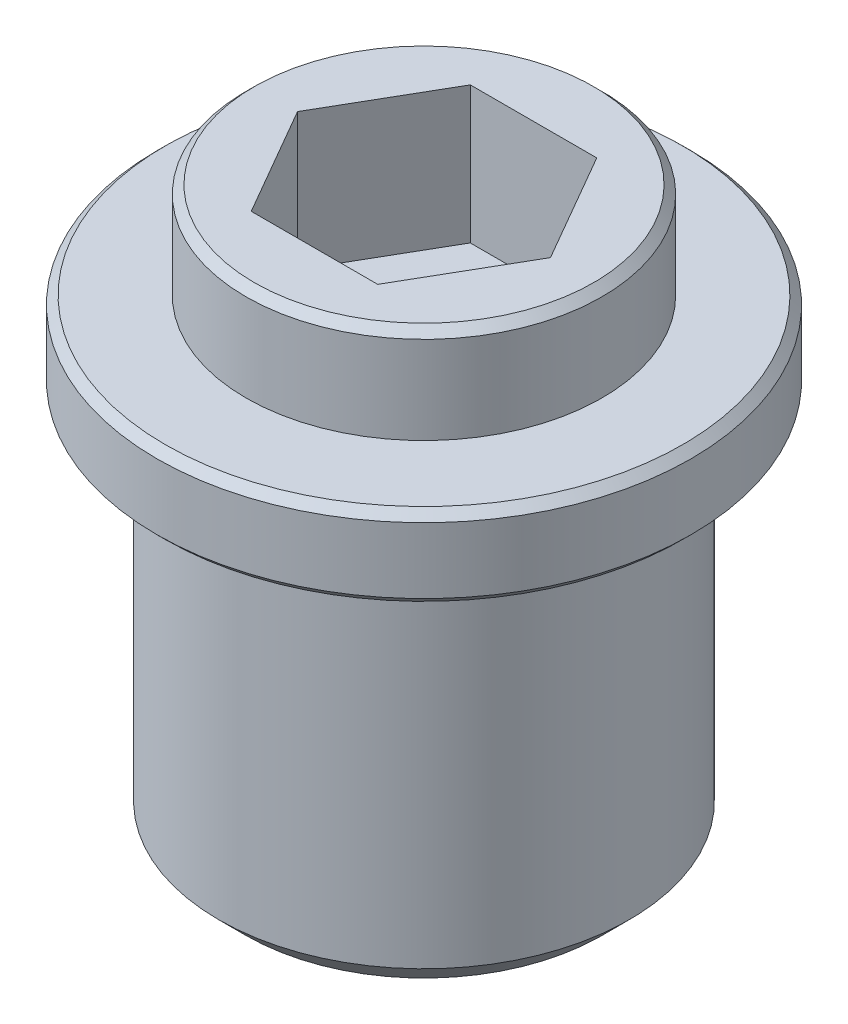
ISO-10303-21;
HEADER;
FILE_DESCRIPTION(('STEP AP214'),'2;1');
FILE_NAME('part.step','',(''),(''),'','','');
FILE_SCHEMA(('AUTOMOTIVE_DESIGN { 1 0 10303 214 1 1 1 1 }'));
ENDSEC;
DATA;
#1=APPLICATION_CONTEXT('core data for automotive mechanical design processes');
#2=APPLICATION_PROTOCOL_DEFINITION('international standard','automotive_design',2000,#1);
#3=PRODUCT_CONTEXT('',#1,'mechanical');
#4=PRODUCT('Part','Part','',(#3));
#5=PRODUCT_RELATED_PRODUCT_CATEGORY('part','',(#4));
#6=PRODUCT_DEFINITION_FORMATION('','',#4);
#7=PRODUCT_DEFINITION_CONTEXT('part definition',#1,'design');
#8=PRODUCT_DEFINITION('design','',#6,#7);
#9=PRODUCT_DEFINITION_SHAPE('','',#8);
#10=(LENGTH_UNIT() NAMED_UNIT(*) SI_UNIT(.MILLI.,.METRE.));
#11=(NAMED_UNIT(*) PLANE_ANGLE_UNIT() SI_UNIT($,.RADIAN.));
#12=(NAMED_UNIT(*) SI_UNIT($,.STERADIAN.) SOLID_ANGLE_UNIT());
#13=UNCERTAINTY_MEASURE_WITH_UNIT(LENGTH_MEASURE(1.E-05),#10,'distance_accuracy_value','');
#14=(GEOMETRIC_REPRESENTATION_CONTEXT(3) GLOBAL_UNCERTAINTY_ASSIGNED_CONTEXT((#13)) GLOBAL_UNIT_ASSIGNED_CONTEXT((#10,
#11,#12)) REPRESENTATION_CONTEXT('',''));
#15=CARTESIAN_POINT('',(0.,0.,0.));
#16=DIRECTION('',(0.,0.,1.));
#17=DIRECTION('',(1.,0.,0.));
#18=AXIS2_PLACEMENT_3D('',#15,#16,#17);
#19=CARTESIAN_POINT('',(0.,3.,0.));
#20=DIRECTION('',(0.,1.,0.));
#21=DIRECTION('',(0.,0.,1.));
#22=AXIS2_PLACEMENT_3D('',#19,#20,#21);
#23=PLANE('',#22);
#24=CARTESIAN_POINT('',(0.,3.,0.));
#25=DIRECTION('',(0.,1.,0.));
#26=DIRECTION('',(0.,0.,1.));
#27=AXIS2_PLACEMENT_3D('',#24,#25,#26);
#28=CIRCLE('',#27,9.44999999999999);
#29=CARTESIAN_POINT('',(0.,3.,9.44999999999999));
#30=VERTEX_POINT('',#29);
#31=EDGE_CURVE('E161',#30,#30,#28,.T.);
#32=ORIENTED_EDGE('',*,*,#31,.T.);
#33=EDGE_LOOP('',(#32));
#34=FACE_BOUND('',#33,.T.);
#35=CARTESIAN_POINT('',(0.,3.,0.));
#36=DIRECTION('',(0.,1.,0.));
#37=DIRECTION('',(0.,0.,1.));
#38=AXIS2_PLACEMENT_3D('',#35,#36,#37);
#39=CIRCLE('',#38,6.5);
#40=CARTESIAN_POINT('',(0.,3.,6.5));
#41=VERTEX_POINT('',#40);
#42=EDGE_CURVE('E140',#41,#41,#39,.F.);
#43=ORIENTED_EDGE('',*,*,#42,.T.);
#44=EDGE_LOOP('',(#43));
#45=FACE_BOUND('',#44,.T.);
#46=ADVANCED_FACE('F26',(#34,#45),#23,.T.);
#47=CARTESIAN_POINT('',(0.,-14.,0.));
#48=DIRECTION('',(0.,1.,0.));
#49=DIRECTION('',(0.,0.,1.));
#50=AXIS2_PLACEMENT_3D('',#47,#48,#49);
#51=CYLINDRICAL_SURFACE('',#50,7.5);
#52=CARTESIAN_POINT('',(0.,-13.,0.));
#53=DIRECTION('',(0.,1.,0.));
#54=DIRECTION('',(0.,0.,1.));
#55=AXIS2_PLACEMENT_3D('',#52,#53,#54);
#56=CIRCLE('',#55,7.5);
#57=CARTESIAN_POINT('',(0.,-13.,7.5));
#58=VERTEX_POINT('',#57);
#59=EDGE_CURVE('E144',#58,#58,#56,.T.);
#60=ORIENTED_EDGE('',*,*,#59,.T.);
#61=EDGE_LOOP('',(#60));
#62=FACE_BOUND('',#61,.T.);
#63=CARTESIAN_POINT('',(0.,0.,0.));
#64=DIRECTION('',(0.,1.,0.));
#65=DIRECTION('',(0.,0.,1.));
#66=AXIS2_PLACEMENT_3D('',#63,#64,#65);
#67=CIRCLE('',#66,7.5);
#68=CARTESIAN_POINT('',(0.,0.,7.5));
#69=VERTEX_POINT('',#68);
#70=EDGE_CURVE('E141',#69,#69,#67,.T.);
#71=ORIENTED_EDGE('',*,*,#70,.F.);
#72=EDGE_LOOP('',(#71));
#73=FACE_BOUND('',#72,.T.);
#74=ADVANCED_FACE('F28',(#62,#73),#51,.T.);
#75=CARTESIAN_POINT('',(0.,-14.,0.));
#76=DIRECTION('',(0.,1.,0.));
#77=DIRECTION('',(0.,0.,1.));
#78=AXIS2_PLACEMENT_3D('',#75,#76,#77);
#79=PLANE('',#78);
#80=CARTESIAN_POINT('',(0.,-14.,0.));
#81=DIRECTION('',(0.,1.,0.));
#82=DIRECTION('',(0.,0.,1.));
#83=AXIS2_PLACEMENT_3D('',#80,#81,#82);
#84=CIRCLE('',#83,6.5);
#85=CARTESIAN_POINT('',(0.,-14.,6.5));
#86=VERTEX_POINT('',#85);
#87=EDGE_CURVE('E149',#86,#86,#84,.F.);
#88=ORIENTED_EDGE('',*,*,#87,.T.);
#89=EDGE_LOOP('',(#88));
#90=FACE_BOUND('',#89,.T.);
#91=CARTESIAN_POINT('',(0.,-14.,0.));
#92=DIRECTION('',(0.,-1.,0.));
#93=DIRECTION('',(0.,0.,-1.));
#94=AXIS2_PLACEMENT_3D('',#91,#92,#93);
#95=CIRCLE('',#94,4.5);
#96=CARTESIAN_POINT('',(0.,-14.,-4.5));
#97=VERTEX_POINT('',#96);
#98=EDGE_CURVE('E128',#97,#97,#95,.T.);
#99=ORIENTED_EDGE('',*,*,#98,.F.);
#100=EDGE_LOOP('',(#99));
#101=FACE_BOUND('',#100,.T.);
#102=ADVANCED_FACE('F187',(#90,#101),#79,.F.);
#103=CARTESIAN_POINT('',(0.,3.,0.));
#104=DIRECTION('',(0.,-1.,0.));
#105=DIRECTION('',(0.,0.,-1.));
#106=AXIS2_PLACEMENT_3D('',#103,#104,#105);
#107=CYLINDRICAL_SURFACE('',#106,9.75);
#108=CARTESIAN_POINT('',(0.,0.299999999999995,0.));
#109=DIRECTION('',(0.,1.,0.));
#110=DIRECTION('',(0.,0.,1.));
#111=AXIS2_PLACEMENT_3D('',#108,#109,#110);
#112=CIRCLE('',#111,9.75);
#113=CARTESIAN_POINT('',(0.,0.299999999999995,9.75));
#114=VERTEX_POINT('',#113);
#115=EDGE_CURVE('E155',#114,#114,#112,.T.);
#116=ORIENTED_EDGE('',*,*,#115,.T.);
#117=EDGE_LOOP('',(#116));
#118=FACE_BOUND('',#117,.T.);
#119=CARTESIAN_POINT('',(0.,2.69999999999998,0.));
#120=DIRECTION('',(0.,1.,0.));
#121=DIRECTION('',(0.,0.,1.));
#122=AXIS2_PLACEMENT_3D('',#119,#120,#121);
#123=CIRCLE('',#122,9.75);
#124=CARTESIAN_POINT('',(0.,2.69999999999998,9.75));
#125=VERTEX_POINT('',#124);
#126=EDGE_CURVE('E152',#125,#125,#123,.F.);
#127=ORIENTED_EDGE('',*,*,#126,.T.);
#128=EDGE_LOOP('',(#127));
#129=FACE_BOUND('',#128,.T.);
#130=ADVANCED_FACE('F194',(#118,#129),#107,.T.);
#131=CARTESIAN_POINT('',(0.,0.,0.));
#132=DIRECTION('',(0.,1.,0.));
#133=DIRECTION('',(0.,0.,1.));
#134=AXIS2_PLACEMENT_3D('',#131,#132,#133);
#135=PLANE('',#134);
#136=CARTESIAN_POINT('',(0.,0.,0.));
#137=DIRECTION('',(0.,1.,0.));
#138=DIRECTION('',(0.,0.,1.));
#139=AXIS2_PLACEMENT_3D('',#136,#137,#138);
#140=CIRCLE('',#139,9.45);
#141=CARTESIAN_POINT('',(0.,0.,9.45));
#142=VERTEX_POINT('',#141);
#143=EDGE_CURVE('E158',#142,#142,#140,.F.);
#144=ORIENTED_EDGE('',*,*,#143,.T.);
#145=EDGE_LOOP('',(#144));
#146=FACE_BOUND('',#145,.T.);
#147=ORIENTED_EDGE('',*,*,#70,.T.);
#148=EDGE_LOOP('',(#147));
#149=FACE_BOUND('',#148,.T.);
#150=ADVANCED_FACE('F192',(#146,#149),#135,.F.);
#151=CARTESIAN_POINT('',(0.,6.50000000000001,0.));
#152=DIRECTION('',(0.,-1.,0.));
#153=DIRECTION('',(0.,0.,-1.));
#154=AXIS2_PLACEMENT_3D('',#151,#152,#153);
#155=CYLINDRICAL_SURFACE('',#154,6.5);
#156=CARTESIAN_POINT('',(0.,6.20000000000001,0.));
#157=DIRECTION('',(0.,1.,0.));
#158=DIRECTION('',(0.,0.,1.));
#159=AXIS2_PLACEMENT_3D('',#156,#157,#158);
#160=CIRCLE('',#159,6.5);
#161=CARTESIAN_POINT('',(0.,6.20000000000001,6.5));
#162=VERTEX_POINT('',#161);
#163=EDGE_CURVE('E11',#162,#162,#160,.F.);
#164=ORIENTED_EDGE('',*,*,#163,.T.);
#165=EDGE_LOOP('',(#164));
#166=FACE_BOUND('',#165,.T.);
#167=ORIENTED_EDGE('',*,*,#42,.F.);
#168=EDGE_LOOP('',(#167));
#169=FACE_BOUND('',#168,.T.);
#170=ADVANCED_FACE('F217',(#166,#169),#155,.T.);
#171=CARTESIAN_POINT('',(0.,6.50000000000001,0.));
#172=DIRECTION('',(0.,1.,0.));
#173=DIRECTION('',(0.,0.,1.));
#174=AXIS2_PLACEMENT_3D('',#171,#172,#173);
#175=PLANE('',#174);
#176=CARTESIAN_POINT('',(0.,6.50000000000001,0.));
#177=DIRECTION('',(0.,1.,0.));
#178=DIRECTION('',(0.,0.,1.));
#179=AXIS2_PLACEMENT_3D('',#176,#177,#178);
#180=CIRCLE('',#179,6.20000000000002);
#181=CARTESIAN_POINT('',(0.,6.50000000000001,6.20000000000002));
#182=VERTEX_POINT('',#181);
#183=EDGE_CURVE('E34',#182,#182,#180,.T.);
#184=ORIENTED_EDGE('',*,*,#183,.T.);
#185=EDGE_LOOP('',(#184));
#186=FACE_BOUND('',#185,.T.);
#187=DIRECTION('',(0.5,0.,-0.866025403784439));
#188=VECTOR('',#187,1.);
#189=CARTESIAN_POINT('',(2.3094010767585,6.50000000000001,4.));
#190=LINE('',#189,#188);
#191=CARTESIAN_POINT('',(2.3094010767585,6.50000000000001,4.));
#192=VERTEX_POINT('',#191);
#193=CARTESIAN_POINT('',(4.61880215351701,6.50000000000001,0.));
#194=VERTEX_POINT('',#193);
#195=EDGE_CURVE('E41',#192,#194,#190,.T.);
#196=ORIENTED_EDGE('',*,*,#195,.F.);
#197=DIRECTION('',(1.,0.,0.));
#198=VECTOR('',#197,1.);
#199=CARTESIAN_POINT('',(-2.3094010767585,6.50000000000001,4.));
#200=LINE('',#199,#198);
#201=CARTESIAN_POINT('',(-2.3094010767585,6.50000000000001,4.));
#202=VERTEX_POINT('',#201);
#203=EDGE_CURVE('E110',#202,#192,#200,.T.);
#204=ORIENTED_EDGE('',*,*,#203,.F.);
#205=DIRECTION('',(0.5,0.,0.866025403784439));
#206=VECTOR('',#205,1.);
#207=CARTESIAN_POINT('',(-4.618802153517,6.50000000000001,0.));
#208=LINE('',#207,#206);
#209=CARTESIAN_POINT('',(-4.618802153517,6.50000000000001,0.));
#210=VERTEX_POINT('',#209);
#211=EDGE_CURVE('E104',#210,#202,#208,.T.);
#212=ORIENTED_EDGE('',*,*,#211,.F.);
#213=DIRECTION('',(-0.5,0.,0.866025403784439));
#214=VECTOR('',#213,1.);
#215=CARTESIAN_POINT('',(-2.3094010767585,6.50000000000001,-4.));
#216=LINE('',#215,#214);
#217=CARTESIAN_POINT('',(-2.3094010767585,6.50000000000001,-4.));
#218=VERTEX_POINT('',#217);
#219=EDGE_CURVE('E102',#218,#210,#216,.T.);
#220=ORIENTED_EDGE('',*,*,#219,.F.);
#221=DIRECTION('',(-1.,0.,0.));
#222=VECTOR('',#221,1.);
#223=CARTESIAN_POINT('',(2.30940107675851,6.50000000000001,-4.));
#224=LINE('',#223,#222);
#225=CARTESIAN_POINT('',(2.30940107675851,6.50000000000001,-4.));
#226=VERTEX_POINT('',#225);
#227=EDGE_CURVE('E84',#226,#218,#224,.T.);
#228=ORIENTED_EDGE('',*,*,#227,.F.);
#229=DIRECTION('',(-0.5,0.,-0.866025403784439));
#230=VECTOR('',#229,1.);
#231=CARTESIAN_POINT('',(4.61880215351701,6.50000000000001,0.));
#232=LINE('',#231,#230);
#233=EDGE_CURVE('E95',#194,#226,#232,.T.);
#234=ORIENTED_EDGE('',*,*,#233,.F.);
#235=EDGE_LOOP('',(#196,#204,#212,#220,#228,#234));
#236=FACE_BOUND('',#235,.T.);
#237=ADVANCED_FACE('F99',(#186,#236),#175,.T.);
#238=CARTESIAN_POINT('',(0.,-1.5,0.));
#239=DIRECTION('',(0.,-1.,0.));
#240=DIRECTION('',(0.,0.,-1.));
#241=AXIS2_PLACEMENT_3D('',#238,#239,#240);
#242=CYLINDRICAL_SURFACE('',#241,4.5);
#243=CARTESIAN_POINT('',(0.,-1.5,0.));
#244=DIRECTION('',(0.,-1.,0.));
#245=DIRECTION('',(0.,0.,-1.));
#246=AXIS2_PLACEMENT_3D('',#243,#244,#245);
#247=CIRCLE('',#246,4.5);
#248=CARTESIAN_POINT('',(0.,-1.5,-4.5));
#249=VERTEX_POINT('',#248);
#250=EDGE_CURVE('E137',#249,#249,#247,.T.);
#251=ORIENTED_EDGE('',*,*,#250,.F.);
#252=EDGE_LOOP('',(#251));
#253=FACE_BOUND('',#252,.T.);
#254=ORIENTED_EDGE('',*,*,#98,.T.);
#255=EDGE_LOOP('',(#254));
#256=FACE_BOUND('',#255,.T.);
#257=ADVANCED_FACE('F205',(#253,#256),#242,.F.);
#258=CARTESIAN_POINT('',(0.,-1.5,0.));
#259=DIRECTION('',(0.,-1.,0.));
#260=DIRECTION('',(0.,0.,-1.));
#261=AXIS2_PLACEMENT_3D('',#258,#259,#260);
#262=PLANE('',#261);
#263=ORIENTED_EDGE('',*,*,#250,.T.);
#264=EDGE_LOOP('',(#263));
#265=FACE_BOUND('',#264,.T.);
#266=ADVANCED_FACE('F207',(#265),#262,.T.);
#267=CARTESIAN_POINT('',(2.3094010767585,1.5,4.));
#268=DIRECTION('',(0.866025403784439,0.,0.5));
#269=DIRECTION('',(0.5,0.,-0.866025403784439));
#270=AXIS2_PLACEMENT_3D('',#267,#268,#269);
#271=PLANE('',#270);
#272=ORIENTED_EDGE('',*,*,#195,.T.);
#273=DIRECTION('',(0.,1.,0.));
#274=VECTOR('',#273,1.);
#275=CARTESIAN_POINT('',(4.61880215351701,1.5,0.));
#276=LINE('',#275,#274);
#277=CARTESIAN_POINT('',(4.61880215351701,1.5,0.));
#278=VERTEX_POINT('',#277);
#279=EDGE_CURVE('E92',#278,#194,#276,.T.);
#280=ORIENTED_EDGE('',*,*,#279,.F.);
#281=DIRECTION('',(0.5,0.,-0.866025403784439));
#282=VECTOR('',#281,1.);
#283=CARTESIAN_POINT('',(2.3094010767585,1.5,4.));
#284=LINE('',#283,#282);
#285=CARTESIAN_POINT('',(2.3094010767585,1.5,4.));
#286=VERTEX_POINT('',#285);
#287=EDGE_CURVE('E112',#286,#278,#284,.T.);
#288=ORIENTED_EDGE('',*,*,#287,.F.);
#289=DIRECTION('',(0.,1.,0.));
#290=VECTOR('',#289,1.);
#291=CARTESIAN_POINT('',(2.3094010767585,1.5,4.));
#292=LINE('',#291,#290);
#293=EDGE_CURVE('E48',#286,#192,#292,.T.);
#294=ORIENTED_EDGE('',*,*,#293,.T.);
#295=EDGE_LOOP('',(#272,#280,#288,#294));
#296=FACE_BOUND('',#295,.T.);
#297=ADVANCED_FACE('F214',(#296),#271,.F.);
#298=CARTESIAN_POINT('',(-2.3094010767585,1.5,4.));
#299=DIRECTION('',(0.,0.,1.));
#300=DIRECTION('',(1.,0.,0.));
#301=AXIS2_PLACEMENT_3D('',#298,#299,#300);
#302=PLANE('',#301);
#303=ORIENTED_EDGE('',*,*,#203,.T.);
#304=ORIENTED_EDGE('',*,*,#293,.F.);
#305=DIRECTION('',(1.,0.,0.));
#306=VECTOR('',#305,1.);
#307=CARTESIAN_POINT('',(-2.3094010767585,1.5,4.));
#308=LINE('',#307,#306);
#309=CARTESIAN_POINT('',(-2.3094010767585,1.5,4.));
#310=VERTEX_POINT('',#309);
#311=EDGE_CURVE('E124',#310,#286,#308,.T.);
#312=ORIENTED_EDGE('',*,*,#311,.F.);
#313=DIRECTION('',(0.,1.,0.));
#314=VECTOR('',#313,1.);
#315=CARTESIAN_POINT('',(-2.3094010767585,1.5,4.));
#316=LINE('',#315,#314);
#317=EDGE_CURVE('E129',#310,#202,#316,.T.);
#318=ORIENTED_EDGE('',*,*,#317,.T.);
#319=EDGE_LOOP('',(#303,#304,#312,#318));
#320=FACE_BOUND('',#319,.T.);
#321=ADVANCED_FACE('F253',(#320),#302,.F.);
#322=CARTESIAN_POINT('',(-4.618802153517,1.5,0.));
#323=DIRECTION('',(-0.866025403784439,0.,0.5));
#324=DIRECTION('',(0.5,0.,0.866025403784439));
#325=AXIS2_PLACEMENT_3D('',#322,#323,#324);
#326=PLANE('',#325);
#327=ORIENTED_EDGE('',*,*,#211,.T.);
#328=ORIENTED_EDGE('',*,*,#317,.F.);
#329=DIRECTION('',(0.5,0.,0.866025403784439));
#330=VECTOR('',#329,1.);
#331=CARTESIAN_POINT('',(-4.618802153517,1.5,0.));
#332=LINE('',#331,#330);
#333=CARTESIAN_POINT('',(-4.618802153517,1.5,0.));
#334=VERTEX_POINT('',#333);
#335=EDGE_CURVE('E121',#334,#310,#332,.T.);
#336=ORIENTED_EDGE('',*,*,#335,.F.);
#337=DIRECTION('',(0.,1.,0.));
#338=VECTOR('',#337,1.);
#339=CARTESIAN_POINT('',(-4.618802153517,1.5,0.));
#340=LINE('',#339,#338);
#341=EDGE_CURVE('E131',#334,#210,#340,.T.);
#342=ORIENTED_EDGE('',*,*,#341,.T.);
#343=EDGE_LOOP('',(#327,#328,#336,#342));
#344=FACE_BOUND('',#343,.T.);
#345=ADVANCED_FACE('F256',(#344),#326,.F.);
#346=CARTESIAN_POINT('',(-2.3094010767585,1.5,-4.));
#347=DIRECTION('',(-0.866025403784439,0.,-0.5));
#348=DIRECTION('',(-0.5,0.,0.866025403784439));
#349=AXIS2_PLACEMENT_3D('',#346,#347,#348);
#350=PLANE('',#349);
#351=ORIENTED_EDGE('',*,*,#219,.T.);
#352=ORIENTED_EDGE('',*,*,#341,.F.);
#353=DIRECTION('',(-0.5,0.,0.866025403784439));
#354=VECTOR('',#353,1.);
#355=CARTESIAN_POINT('',(-2.3094010767585,1.5,-4.));
#356=LINE('',#355,#354);
#357=CARTESIAN_POINT('',(-2.3094010767585,1.5,-4.));
#358=VERTEX_POINT('',#357);
#359=EDGE_CURVE('E118',#358,#334,#356,.T.);
#360=ORIENTED_EDGE('',*,*,#359,.F.);
#361=DIRECTION('',(0.,1.,0.));
#362=VECTOR('',#361,1.);
#363=CARTESIAN_POINT('',(-2.3094010767585,1.5,-4.));
#364=LINE('',#363,#362);
#365=EDGE_CURVE('E91',#358,#218,#364,.T.);
#366=ORIENTED_EDGE('',*,*,#365,.T.);
#367=EDGE_LOOP('',(#351,#352,#360,#366));
#368=FACE_BOUND('',#367,.T.);
#369=ADVANCED_FACE('F259',(#368),#350,.F.);
#370=CARTESIAN_POINT('',(2.30940107675851,1.5,-4.));
#371=DIRECTION('',(0.,0.,-1.));
#372=DIRECTION('',(-1.,0.,0.));
#373=AXIS2_PLACEMENT_3D('',#370,#371,#372);
#374=PLANE('',#373);
#375=ORIENTED_EDGE('',*,*,#227,.T.);
#376=ORIENTED_EDGE('',*,*,#365,.F.);
#377=DIRECTION('',(-1.,0.,0.));
#378=VECTOR('',#377,1.);
#379=CARTESIAN_POINT('',(2.30940107675851,1.5,-4.));
#380=LINE('',#379,#378);
#381=CARTESIAN_POINT('',(2.30940107675851,1.5,-4.));
#382=VERTEX_POINT('',#381);
#383=EDGE_CURVE('E87',#382,#358,#380,.T.);
#384=ORIENTED_EDGE('',*,*,#383,.F.);
#385=DIRECTION('',(0.,1.,0.));
#386=VECTOR('',#385,1.);
#387=CARTESIAN_POINT('',(2.30940107675851,1.5,-4.));
#388=LINE('',#387,#386);
#389=EDGE_CURVE('E80',#382,#226,#388,.T.);
#390=ORIENTED_EDGE('',*,*,#389,.T.);
#391=EDGE_LOOP('',(#375,#376,#384,#390));
#392=FACE_BOUND('',#391,.T.);
#393=ADVANCED_FACE('F82',(#392),#374,.F.);
#394=CARTESIAN_POINT('',(4.61880215351701,1.5,0.));
#395=DIRECTION('',(0.866025403784439,0.,-0.5));
#396=DIRECTION('',(-0.5,0.,-0.866025403784439));
#397=AXIS2_PLACEMENT_3D('',#394,#395,#396);
#398=PLANE('',#397);
#399=ORIENTED_EDGE('',*,*,#233,.T.);
#400=ORIENTED_EDGE('',*,*,#389,.F.);
#401=DIRECTION('',(-0.5,0.,-0.866025403784439));
#402=VECTOR('',#401,1.);
#403=CARTESIAN_POINT('',(4.61880215351701,1.5,0.));
#404=LINE('',#403,#402);
#405=EDGE_CURVE('E115',#278,#382,#404,.T.);
#406=ORIENTED_EDGE('',*,*,#405,.F.);
#407=ORIENTED_EDGE('',*,*,#279,.T.);
#408=EDGE_LOOP('',(#399,#400,#406,#407));
#409=FACE_BOUND('',#408,.T.);
#410=ADVANCED_FACE('F96',(#409),#398,.F.);
#411=CARTESIAN_POINT('',(4.61880215351701,1.5,0.));
#412=DIRECTION('',(0.,1.,0.));
#413=DIRECTION('',(0.,0.,1.));
#414=AXIS2_PLACEMENT_3D('',#411,#412,#413);
#415=PLANE('',#414);
#416=ORIENTED_EDGE('',*,*,#287,.T.);
#417=ORIENTED_EDGE('',*,*,#405,.T.);
#418=ORIENTED_EDGE('',*,*,#383,.T.);
#419=ORIENTED_EDGE('',*,*,#359,.T.);
#420=ORIENTED_EDGE('',*,*,#335,.T.);
#421=ORIENTED_EDGE('',*,*,#311,.T.);
#422=EDGE_LOOP('',(#416,#417,#418,#419,#420,#421));
#423=FACE_BOUND('',#422,.T.);
#424=ADVANCED_FACE('F246',(#423),#415,.T.);
#425=CARTESIAN_POINT('',(0.,-13.,0.));
#426=DIRECTION('',(0.,1.,0.));
#427=DIRECTION('',(0.,0.,1.));
#428=AXIS2_PLACEMENT_3D('',#425,#426,#427);
#429=CONICAL_SURFACE('',#428,7.5,0.78539816339745);
#430=ORIENTED_EDGE('',*,*,#87,.F.);
#431=EDGE_LOOP('',(#430));
#432=FACE_BOUND('',#431,.T.);
#433=ORIENTED_EDGE('',*,*,#59,.F.);
#434=EDGE_LOOP('',(#433));
#435=FACE_BOUND('',#434,.T.);
#436=ADVANCED_FACE('F236',(#432,#435),#429,.T.);
#437=CARTESIAN_POINT('',(0.,0.299999999999995,0.));
#438=DIRECTION('',(0.,1.,0.));
#439=DIRECTION('',(0.,0.,1.));
#440=AXIS2_PLACEMENT_3D('',#437,#438,#439);
#441=CONICAL_SURFACE('',#440,9.75,0.785398163397454);
#442=ORIENTED_EDGE('',*,*,#143,.F.);
#443=EDGE_LOOP('',(#442));
#444=FACE_BOUND('',#443,.T.);
#445=ORIENTED_EDGE('',*,*,#115,.F.);
#446=EDGE_LOOP('',(#445));
#447=FACE_BOUND('',#446,.T.);
#448=ADVANCED_FACE('F175',(#444,#447),#441,.T.);
#449=CARTESIAN_POINT('',(0.,3.,0.));
#450=DIRECTION('',(0.,-1.,0.));
#451=DIRECTION('',(0.,0.,-1.));
#452=AXIS2_PLACEMENT_3D('',#449,#450,#451);
#453=CONICAL_SURFACE('',#452,9.44999999999999,0.78539816339744);
#454=ORIENTED_EDGE('',*,*,#126,.F.);
#455=EDGE_LOOP('',(#454));
#456=FACE_BOUND('',#455,.T.);
#457=ORIENTED_EDGE('',*,*,#31,.F.);
#458=EDGE_LOOP('',(#457));
#459=FACE_BOUND('',#458,.T.);
#460=ADVANCED_FACE('F169',(#456,#459),#453,.T.);
#461=CARTESIAN_POINT('',(0.,6.50000000000001,0.));
#462=DIRECTION('',(0.,-1.,0.));
#463=DIRECTION('',(0.,0.,-1.));
#464=AXIS2_PLACEMENT_3D('',#461,#462,#463);
#465=CONICAL_SURFACE('',#464,6.20000000000002,0.785398163397444);
#466=ORIENTED_EDGE('',*,*,#163,.F.);
#467=EDGE_LOOP('',(#466));
#468=FACE_BOUND('',#467,.T.);
#469=ORIENTED_EDGE('',*,*,#183,.F.);
#470=EDGE_LOOP('',(#469));
#471=FACE_BOUND('',#470,.T.);
#472=ADVANCED_FACE('F167',(#468,#471),#465,.T.);
#473=CLOSED_SHELL('',(#46,#74,#102,#130,#150,#170,#237,#257,#266,#297,#321,#345,#369,#393,#410,
#424,#436,#448,#460,#472));
#474=MANIFOLD_SOLID_BREP('B2',#473);
#475=ADVANCED_BREP_SHAPE_REPRESENTATION('',(#18,#474),#14);
#476=SHAPE_DEFINITION_REPRESENTATION(#9,#475);
ENDSEC;
END-ISO-10303-21;
